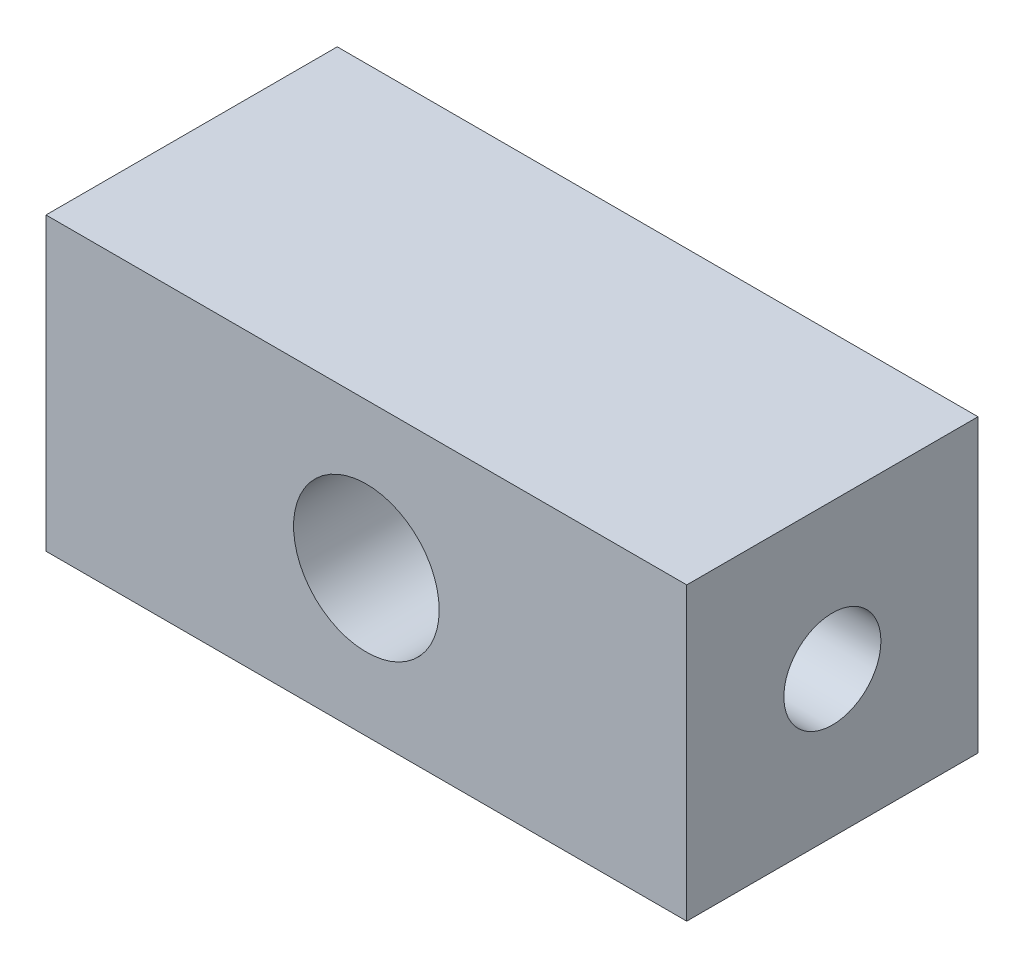
ISO-10303-21;
HEADER;
FILE_DESCRIPTION(('STEP AP214'),'2;1');
FILE_NAME('part.step','',(''),(''),'','','');
FILE_SCHEMA(('AUTOMOTIVE_DESIGN { 1 0 10303 214 1 1 1 1 }'));
ENDSEC;
DATA;
#1=APPLICATION_CONTEXT('core data for automotive mechanical design processes');
#2=APPLICATION_PROTOCOL_DEFINITION('international standard','automotive_design',2000,#1);
#3=PRODUCT_CONTEXT('',#1,'mechanical');
#4=PRODUCT('Part','Part','',(#3));
#5=PRODUCT_RELATED_PRODUCT_CATEGORY('part','',(#4));
#6=PRODUCT_DEFINITION_FORMATION('','',#4);
#7=PRODUCT_DEFINITION_CONTEXT('part definition',#1,'design');
#8=PRODUCT_DEFINITION('design','',#6,#7);
#9=PRODUCT_DEFINITION_SHAPE('','',#8);
#10=(LENGTH_UNIT() NAMED_UNIT(*) SI_UNIT(.MILLI.,.METRE.));
#11=(NAMED_UNIT(*) PLANE_ANGLE_UNIT() SI_UNIT($,.RADIAN.));
#12=(NAMED_UNIT(*) SI_UNIT($,.STERADIAN.) SOLID_ANGLE_UNIT());
#13=UNCERTAINTY_MEASURE_WITH_UNIT(LENGTH_MEASURE(1.E-05),#10,'distance_accuracy_value','');
#14=(GEOMETRIC_REPRESENTATION_CONTEXT(3) GLOBAL_UNCERTAINTY_ASSIGNED_CONTEXT((#13)) GLOBAL_UNIT_ASSIGNED_CONTEXT((#10,
#11,#12)) REPRESENTATION_CONTEXT('',''));
#15=CARTESIAN_POINT('',(0.,0.,0.));
#16=DIRECTION('',(0.,0.,1.));
#17=DIRECTION('',(1.,0.,0.));
#18=AXIS2_PLACEMENT_3D('',#15,#16,#17);
#19=CARTESIAN_POINT('',(0.,0.,15.));
#20=DIRECTION('',(0.,0.,-1.));
#21=DIRECTION('',(-1.,0.,0.));
#22=AXIS2_PLACEMENT_3D('',#19,#20,#21);
#23=PLANE('',#22);
#24=DIRECTION('',(0.,1.,0.));
#25=VECTOR('',#24,1.);
#26=CARTESIAN_POINT('',(33.,-15.,15.));
#27=LINE('',#26,#25);
#28=CARTESIAN_POINT('',(33.,-15.,15.));
#29=VERTEX_POINT('',#28);
#30=CARTESIAN_POINT('',(33.,15.,15.));
#31=VERTEX_POINT('',#30);
#32=EDGE_CURVE('E99',#29,#31,#27,.T.);
#33=ORIENTED_EDGE('',*,*,#32,.T.);
#34=DIRECTION('',(-1.,0.,0.));
#35=VECTOR('',#34,1.);
#36=CARTESIAN_POINT('',(-33.,15.,15.));
#37=LINE('',#36,#35);
#38=CARTESIAN_POINT('',(-33.,15.,15.));
#39=VERTEX_POINT('',#38);
#40=EDGE_CURVE('E94',#31,#39,#37,.T.);
#41=ORIENTED_EDGE('',*,*,#40,.T.);
#42=DIRECTION('',(0.,-1.,0.));
#43=VECTOR('',#42,1.);
#44=CARTESIAN_POINT('',(-33.,-15.,15.));
#45=LINE('',#44,#43);
#46=CARTESIAN_POINT('',(-33.,-15.,15.));
#47=VERTEX_POINT('',#46);
#48=EDGE_CURVE('E97',#39,#47,#45,.T.);
#49=ORIENTED_EDGE('',*,*,#48,.T.);
#50=DIRECTION('',(1.,0.,0.));
#51=VECTOR('',#50,1.);
#52=CARTESIAN_POINT('',(-33.,-15.,15.));
#53=LINE('',#52,#51);
#54=EDGE_CURVE('E64',#47,#29,#53,.T.);
#55=ORIENTED_EDGE('',*,*,#54,.T.);
#56=EDGE_LOOP('',(#33,#41,#49,#55));
#57=FACE_BOUND('',#56,.T.);
#58=CARTESIAN_POINT('',(0.,0.,15.));
#59=DIRECTION('',(0.,0.,1.));
#60=DIRECTION('',(1.,0.,0.));
#61=AXIS2_PLACEMENT_3D('',#58,#59,#60);
#62=CIRCLE('',#61,7.5);
#63=CARTESIAN_POINT('',(7.5,0.,15.));
#64=VERTEX_POINT('',#63);
#65=EDGE_CURVE('E120',#64,#64,#62,.T.);
#66=ORIENTED_EDGE('',*,*,#65,.F.);
#67=EDGE_LOOP('',(#66));
#68=FACE_BOUND('',#67,.T.);
#69=ADVANCED_FACE('F39',(#57,#68),#23,.F.);
#70=CARTESIAN_POINT('',(0.,0.,-15.));
#71=DIRECTION('',(0.,0.,-1.));
#72=DIRECTION('',(-1.,0.,0.));
#73=AXIS2_PLACEMENT_3D('',#70,#71,#72);
#74=PLANE('',#73);
#75=DIRECTION('',(0.,1.,0.));
#76=VECTOR('',#75,1.);
#77=CARTESIAN_POINT('',(33.,-15.,-15.));
#78=LINE('',#77,#76);
#79=CARTESIAN_POINT('',(33.,-15.,-15.));
#80=VERTEX_POINT('',#79);
#81=CARTESIAN_POINT('',(33.,15.,-15.));
#82=VERTEX_POINT('',#81);
#83=EDGE_CURVE('E116',#80,#82,#78,.T.);
#84=ORIENTED_EDGE('',*,*,#83,.F.);
#85=DIRECTION('',(1.,0.,0.));
#86=VECTOR('',#85,1.);
#87=CARTESIAN_POINT('',(-33.,-15.,-15.));
#88=LINE('',#87,#86);
#89=CARTESIAN_POINT('',(-33.,-15.,-15.));
#90=VERTEX_POINT('',#89);
#91=EDGE_CURVE('E87',#90,#80,#88,.T.);
#92=ORIENTED_EDGE('',*,*,#91,.F.);
#93=DIRECTION('',(0.,-1.,0.));
#94=VECTOR('',#93,1.);
#95=CARTESIAN_POINT('',(-33.,-15.,-15.));
#96=LINE('',#95,#94);
#97=CARTESIAN_POINT('',(-33.,15.,-15.));
#98=VERTEX_POINT('',#97);
#99=EDGE_CURVE('E81',#98,#90,#96,.T.);
#100=ORIENTED_EDGE('',*,*,#99,.F.);
#101=DIRECTION('',(-1.,0.,0.));
#102=VECTOR('',#101,1.);
#103=CARTESIAN_POINT('',(-33.,15.,-15.));
#104=LINE('',#103,#102);
#105=EDGE_CURVE('E104',#82,#98,#104,.T.);
#106=ORIENTED_EDGE('',*,*,#105,.F.);
#107=EDGE_LOOP('',(#84,#92,#100,#106));
#108=FACE_BOUND('',#107,.T.);
#109=CARTESIAN_POINT('',(0.,0.,-15.));
#110=DIRECTION('',(0.,0.,1.));
#111=DIRECTION('',(1.,0.,0.));
#112=AXIS2_PLACEMENT_3D('',#109,#110,#111);
#113=CIRCLE('',#112,7.5);
#114=CARTESIAN_POINT('',(7.5,0.,-15.));
#115=VERTEX_POINT('',#114);
#116=EDGE_CURVE('E181',#115,#115,#113,.T.);
#117=ORIENTED_EDGE('',*,*,#116,.T.);
#118=EDGE_LOOP('',(#117));
#119=FACE_BOUND('',#118,.T.);
#120=ADVANCED_FACE('F155',(#108,#119),#74,.T.);
#121=CARTESIAN_POINT('',(33.,-15.,15.));
#122=DIRECTION('',(-1.,0.,0.));
#123=DIRECTION('',(0.,0.,1.));
#124=AXIS2_PLACEMENT_3D('',#121,#122,#123);
#125=PLANE('',#124);
#126=CARTESIAN_POINT('',(33.,0.,0.));
#127=DIRECTION('',(1.,0.,0.));
#128=DIRECTION('',(0.,0.,-1.));
#129=AXIS2_PLACEMENT_3D('',#126,#127,#128);
#130=CIRCLE('',#129,5.);
#131=CARTESIAN_POINT('',(33.,0.,-5.));
#132=VERTEX_POINT('',#131);
#133=EDGE_CURVE('E176',#132,#132,#130,.T.);
#134=ORIENTED_EDGE('',*,*,#133,.F.);
#135=EDGE_LOOP('',(#134));
#136=FACE_BOUND('',#135,.T.);
#137=ORIENTED_EDGE('',*,*,#83,.T.);
#138=DIRECTION('',(0.,0.,-1.));
#139=VECTOR('',#138,1.);
#140=CARTESIAN_POINT('',(33.,15.,15.));
#141=LINE('',#140,#139);
#142=EDGE_CURVE('E11',#31,#82,#141,.T.);
#143=ORIENTED_EDGE('',*,*,#142,.F.);
#144=ORIENTED_EDGE('',*,*,#32,.F.);
#145=DIRECTION('',(0.,0.,-1.));
#146=VECTOR('',#145,1.);
#147=CARTESIAN_POINT('',(33.,-15.,15.));
#148=LINE('',#147,#146);
#149=EDGE_CURVE('E112',#29,#80,#148,.T.);
#150=ORIENTED_EDGE('',*,*,#149,.T.);
#151=EDGE_LOOP('',(#137,#143,#144,#150));
#152=FACE_BOUND('',#151,.T.);
#153=ADVANCED_FACE('F41',(#136,#152),#125,.F.);
#154=CARTESIAN_POINT('',(-33.,15.,15.));
#155=DIRECTION('',(0.,-1.,0.));
#156=DIRECTION('',(0.,0.,-1.));
#157=AXIS2_PLACEMENT_3D('',#154,#155,#156);
#158=PLANE('',#157);
#159=ORIENTED_EDGE('',*,*,#105,.T.);
#160=DIRECTION('',(0.,0.,-1.));
#161=VECTOR('',#160,1.);
#162=CARTESIAN_POINT('',(-33.,15.,15.));
#163=LINE('',#162,#161);
#164=EDGE_CURVE('E55',#39,#98,#163,.T.);
#165=ORIENTED_EDGE('',*,*,#164,.F.);
#166=ORIENTED_EDGE('',*,*,#40,.F.);
#167=ORIENTED_EDGE('',*,*,#142,.T.);
#168=EDGE_LOOP('',(#159,#165,#166,#167));
#169=FACE_BOUND('',#168,.T.);
#170=ADVANCED_FACE('F103',(#169),#158,.F.);
#171=CARTESIAN_POINT('',(-33.,-15.,15.));
#172=DIRECTION('',(1.,0.,0.));
#173=DIRECTION('',(0.,0.,-1.));
#174=AXIS2_PLACEMENT_3D('',#171,#172,#173);
#175=PLANE('',#174);
#176=CARTESIAN_POINT('',(-33.,0.,0.));
#177=DIRECTION('',(1.,0.,0.));
#178=DIRECTION('',(0.,0.,-1.));
#179=AXIS2_PLACEMENT_3D('',#176,#177,#178);
#180=CIRCLE('',#179,5.);
#181=CARTESIAN_POINT('',(-33.,0.,-5.));
#182=VERTEX_POINT('',#181);
#183=EDGE_CURVE('E136',#182,#182,#180,.T.);
#184=ORIENTED_EDGE('',*,*,#183,.T.);
#185=EDGE_LOOP('',(#184));
#186=FACE_BOUND('',#185,.T.);
#187=ORIENTED_EDGE('',*,*,#99,.T.);
#188=DIRECTION('',(0.,0.,-1.));
#189=VECTOR('',#188,1.);
#190=CARTESIAN_POINT('',(-33.,-15.,15.));
#191=LINE('',#190,#189);
#192=EDGE_CURVE('E106',#47,#90,#191,.T.);
#193=ORIENTED_EDGE('',*,*,#192,.F.);
#194=ORIENTED_EDGE('',*,*,#48,.F.);
#195=ORIENTED_EDGE('',*,*,#164,.T.);
#196=EDGE_LOOP('',(#187,#193,#194,#195));
#197=FACE_BOUND('',#196,.T.);
#198=ADVANCED_FACE('F108',(#186,#197),#175,.F.);
#199=CARTESIAN_POINT('',(-33.,-15.,15.));
#200=DIRECTION('',(0.,1.,0.));
#201=DIRECTION('',(0.,0.,1.));
#202=AXIS2_PLACEMENT_3D('',#199,#200,#201);
#203=PLANE('',#202);
#204=ORIENTED_EDGE('',*,*,#91,.T.);
#205=ORIENTED_EDGE('',*,*,#149,.F.);
#206=ORIENTED_EDGE('',*,*,#54,.F.);
#207=ORIENTED_EDGE('',*,*,#192,.T.);
#208=EDGE_LOOP('',(#204,#205,#206,#207));
#209=FACE_BOUND('',#208,.T.);
#210=ADVANCED_FACE('F151',(#209),#203,.F.);
#211=CARTESIAN_POINT('',(0.,0.,15.));
#212=DIRECTION('',(0.,0.,-1.));
#213=DIRECTION('',(-1.,0.,0.));
#214=AXIS2_PLACEMENT_3D('',#211,#212,#213);
#215=CYLINDRICAL_SURFACE('',#214,7.5);
#216=CARTESIAN_POINT('',(-7.5,0.,5.));
#217=CARTESIAN_POINT('',(-7.49999996320963,-0.125608018588548,4.99999996332958));
#218=CARTESIAN_POINT('',(-7.49683780664486,-0.251216670884861,4.99526045609656));
#219=CARTESIAN_POINT('',(-7.48426887523008,-0.501407130429646,4.97637719344278));
#220=CARTESIAN_POINT('',(-7.47486206751269,-0.625988932270019,4.96223338852455));
#221=CARTESIAN_POINT('',(-7.45003382341075,-0.873171719994341,4.92475388496588));
#222=CARTESIAN_POINT('',(-7.43461128487837,-0.99577233861483,4.90141650195336));
#223=CARTESIAN_POINT('',(-7.39811136676745,-1.23813427215697,4.84587344243482));
#224=CARTESIAN_POINT('',(-7.37703158367565,-1.35789435666897,4.8136639964275));
#225=CARTESIAN_POINT('',(-7.32981525375344,-1.59314893798378,4.74098638489601));
#226=CARTESIAN_POINT('',(-7.30370546494928,-1.70866231614512,4.70056186113887));
#227=CARTESIAN_POINT('',(-7.24690654349893,-1.93546860882204,4.61181215495731));
#228=CARTESIAN_POINT('',(-7.21621562725325,-2.04675985824915,4.56348389461676));
#229=CARTESIAN_POINT('',(-7.11817827260879,-2.37341381762447,4.40738741786011));
#230=CARTESIAN_POINT('',(-7.04482484943509,-2.58175996249981,4.28844372586616));
#231=CARTESIAN_POINT('',(-6.88067945428324,-2.99324442404475,4.01334849863612));
#232=CARTESIAN_POINT('',(-6.78893589581815,-3.19444057723902,3.85489609546823));
#233=CARTESIAN_POINT('',(-6.59954434905881,-3.56933031224002,3.51065910883303));
#234=CARTESIAN_POINT('',(-6.5018880214744,-3.74298373794807,3.32483536621252));
#235=CARTESIAN_POINT('',(-6.34919628009922,-3.99366214280298,3.01202024399453));
#236=CARTESIAN_POINT('',(-6.29351311736736,-4.08060552383283,2.89316385177453));
#237=CARTESIAN_POINT('',(-6.18443450280949,-4.24410607449973,2.6475199343164));
#238=CARTESIAN_POINT('',(-6.13103957232405,-4.32066088576891,2.52073061769334));
#239=CARTESIAN_POINT('',(-5.97715554289977,-4.53366662201286,2.12929062591451));
#240=CARTESIAN_POINT('',(-5.88264084043698,-4.65396866792279,1.85293596756271));
#241=CARTESIAN_POINT('',(-5.74940066178898,-4.81686735383668,1.3581492370559));
#242=CARTESIAN_POINT('',(-5.70244638338744,-4.87187088253824,1.1460313437967));
#243=CARTESIAN_POINT('',(-5.64915905133327,-4.93332515657475,0.821257693119102));
#244=CARTESIAN_POINT('',(-5.63425589706967,-4.95029943249,0.711934830996303));
#245=CARTESIAN_POINT('',(-5.61069296640748,-4.97699249744458,0.491757384373762));
#246=CARTESIAN_POINT('',(-5.6020309479698,-4.98671389202271,0.38090336452041));
#247=CARTESIAN_POINT('',(-5.59128886396067,-4.99875512937179,0.157992425508245));
#248=CARTESIAN_POINT('',(-5.58923742257986,-5.00104278396599,0.045932377579079));
#249=CARTESIAN_POINT('',(-5.5918825450767,-4.9980849918467,-0.17800706469552));
#250=CARTESIAN_POINT('',(-5.59657913187616,-4.99283951954458,-0.289886458426012));
#251=CARTESIAN_POINT('',(-5.61252620448123,-4.97490634187683,-0.512636091336137));
#252=CARTESIAN_POINT('',(-5.62378029227563,-4.96221454627213,-0.623505741850759));
#253=CARTESIAN_POINT('',(-5.65238050674852,-4.92961024185719,-0.843396564451179));
#254=CARTESIAN_POINT('',(-5.66972910561612,-4.90969480272766,-0.952416967563864));
#255=CARTESIAN_POINT('',(-5.72818076911837,-4.84163703367357,-1.26603456504467));
#256=CARTESIAN_POINT('',(-5.77653702126334,-4.78429713380928,-1.46736629283408));
#257=CARTESIAN_POINT('',(-5.88774075486078,-4.64674861534595,-1.85759628783405));
#258=CARTESIAN_POINT('',(-5.95059300345544,-4.56653247162609,-2.0464904385054));
#259=CARTESIAN_POINT('',(-6.09910267461486,-4.36685173998334,-2.44754530140424));
#260=CARTESIAN_POINT('',(-6.18679835791932,-4.24272264703471,-2.65662327497203));
#261=CARTESIAN_POINT('',(-6.36729804082079,-3.96670264496565,-3.05348499728716));
#262=CARTESIAN_POINT('',(-6.46010824109834,-3.81477749526626,-3.24124201432436));
#263=CARTESIAN_POINT('',(-6.60779163713999,-3.54969108213473,-3.52437255800004));
#264=CARTESIAN_POINT('',(-6.66328847782504,-3.44464766421749,-3.62713083172277));
#265=CARTESIAN_POINT('',(-6.77217054484313,-3.22531791748826,-3.82347713970009));
#266=CARTESIAN_POINT('',(-6.82555639146258,-3.11103433427816,-3.9170678798286));
#267=CARTESIAN_POINT('',(-6.92883688982357,-2.87366828778324,-4.09438233562589));
#268=CARTESIAN_POINT('',(-6.97873321853711,-2.75059010925358,-4.17811080427028));
#269=CARTESIAN_POINT('',(-7.07374288615761,-2.49611507932345,-4.33494297641303));
#270=CARTESIAN_POINT('',(-7.11885767470596,-2.36472076856899,-4.40804990259985));
#271=CARTESIAN_POINT('',(-7.1947926112122,-2.12083178608808,-4.52955003710702));
#272=CARTESIAN_POINT('',(-7.22668145195663,-2.00967972723592,-4.57997874330749));
#273=CARTESIAN_POINT('',(-7.2859316600916,-1.78295269143194,-4.67290941874381));
#274=CARTESIAN_POINT('',(-7.31329394408637,-1.66737861576613,-4.71541299299981));
#275=CARTESIAN_POINT('',(-7.36291212748662,-1.43245611415626,-4.79200645983731));
#276=CARTESIAN_POINT('',(-7.38517017742725,-1.31310930196114,-4.82609989626979));
#277=CARTESIAN_POINT('',(-7.42408961793734,-1.07138735730615,-4.88544867675417));
#278=CARTESIAN_POINT('',(-7.44075325872844,-0.949013463736592,-4.91070757446615));
#279=CARTESIAN_POINT('',(-7.4681644674329,-0.701493288803491,-4.95214332041752));
#280=CARTESIAN_POINT('',(-7.4788845658993,-0.576336870259732,-4.96827800575267));
#281=CARTESIAN_POINT('',(-7.4940239148013,-0.324780008160031,-4.9910386561188));
#282=CARTESIAN_POINT('',(-7.49844315700379,-0.198379562978779,-4.99766460872505));
#283=CARTESIAN_POINT('',(-7.50086789804063,0.0546163050195368,-5.00130194416532));
#284=CARTESIAN_POINT('',(-7.49887366122603,0.181211719585368,-4.99831372327676));
#285=CARTESIAN_POINT('',(-7.48852351947421,0.433544937832567,-4.98277210202707));
#286=CARTESIAN_POINT('',(-7.48016788605485,0.559282777885928,-4.97021910991058));
#287=CARTESIAN_POINT('',(-7.45811180800349,0.800084092730023,-4.93696015755831));
#288=CARTESIAN_POINT('',(-7.44483013834048,0.915274689503107,-4.91689203663253));
#289=CARTESIAN_POINT('',(-7.41323727394235,1.14332502618366,-4.86892255510859));
#290=CARTESIAN_POINT('',(-7.39492437584217,1.25618396274926,-4.84101854153162));
#291=CARTESIAN_POINT('',(-7.33297199401165,1.59016819827962,-4.74603269888999));
#292=CARTESIAN_POINT('',(-7.28229985688257,1.80689828647146,-4.66764915658682));
#293=CARTESIAN_POINT('',(-7.16240567052806,2.23669773147039,-4.47836285798313));
#294=CARTESIAN_POINT('',(-7.09224590701723,2.44875011842611,-4.36577789105498));
#295=CARTESIAN_POINT('',(-6.94004723718924,2.8516978970661,-4.11391849994205));
#296=CARTESIAN_POINT('',(-6.85800100215921,3.0425801069499,-3.97462759270444));
#297=CARTESIAN_POINT('',(-6.67386338599776,3.42963933761377,-3.64847975744913));
#298=CARTESIAN_POINT('',(-6.57065384591326,3.62188054324072,-3.45758419366078));
#299=CARTESIAN_POINT('',(-6.36427940129081,3.97334834714671,-3.04722158136621));
#300=CARTESIAN_POINT('',(-6.26111457639159,4.13255212685988,-2.82773495453724));
#301=CARTESIAN_POINT('',(-6.07349195966786,4.40311961015302,-2.38214392019828));
#302=CARTESIAN_POINT('',(-5.98818993185449,4.51739093945808,-2.15816986386051));
#303=CARTESIAN_POINT('',(-5.83597435045316,4.71240530724639,-1.69031842127984));
#304=CARTESIAN_POINT('',(-5.76902777392138,4.79320869285461,-1.44647781589623));
#305=CARTESIAN_POINT('',(-5.67333023681701,4.90589604497064,-0.988588649429973));
#306=CARTESIAN_POINT('',(-5.63987506376385,4.94396476310194,-0.777070027915116));
#307=CARTESIAN_POINT('',(-5.59698654785069,4.99248032394649,-0.348567243612225));
#308=CARTESIAN_POINT('',(-5.58752711368552,5.00295716862677,-0.131589276518499));
#309=CARTESIAN_POINT('',(-5.59410544900805,4.99559738764621,0.301609297155851));
#310=CARTESIAN_POINT('',(-5.61015831597501,4.97774399693959,0.517829379343263));
#311=CARTESIAN_POINT('',(-5.66525973970472,4.91492740617482,0.943352637174756));
#312=CARTESIAN_POINT('',(-5.7043389738479,4.8699280383881,1.15264619119367));
#313=CARTESIAN_POINT('',(-5.81317852459072,4.73981418276009,1.61430721309));
#314=CARTESIAN_POINT('',(-5.88833948649796,4.64720557432273,1.86329193737393));
#315=CARTESIAN_POINT('',(-6.0137282216154,4.48217153169634,2.2197721527126));
#316=CARTESIAN_POINT('',(-6.05768608443999,4.4227291606703,2.33588098122704));
#317=CARTESIAN_POINT('',(-6.14853438480218,4.29553797555823,2.5622633756569));
#318=CARTESIAN_POINT('',(-6.19542487694525,4.22778900678103,2.67253683284727));
#319=CARTESIAN_POINT('',(-6.34038233699541,4.0100125161287,2.99813157273274));
#320=CARTESIAN_POINT('',(-6.44119239434723,3.84739387541879,3.20406498890246));
#321=CARTESIAN_POINT('',(-6.5908294854328,3.58070368138863,3.49223623047968));
#322=CARTESIAN_POINT('',(-6.64046727146306,3.48796686520542,3.5848751310009));
#323=CARTESIAN_POINT('',(-6.73828470699057,3.29502624182907,3.76298200605057));
#324=CARTESIAN_POINT('',(-6.78646402214187,3.19482074044039,3.84844834415119));
#325=CARTESIAN_POINT('',(-6.88712610322217,2.97228582382091,4.02347385839299));
#326=CARTESIAN_POINT('',(-6.93922872778525,2.84884898400047,4.11184847540997));
#327=CARTESIAN_POINT('',(-7.03877400576411,2.59315796105784,4.27770219318705));
#328=CARTESIAN_POINT('',(-7.08621876519301,2.46090780863047,4.35518622493486));
#329=CARTESIAN_POINT('',(-7.17506685821063,2.18836443414478,4.49830278427693));
#330=CARTESIAN_POINT('',(-7.21647581452224,2.04807886951547,4.56394635570691));
#331=CARTESIAN_POINT('',(-7.29200187013099,1.76034275764726,4.68245428044414));
#332=CARTESIAN_POINT('',(-7.32612152964091,1.61289474847383,4.73532312146547));
#333=CARTESIAN_POINT('',(-7.37927647812224,1.34555428333911,4.81710032821547));
#334=CARTESIAN_POINT('',(-7.39997893582426,1.22681585673933,4.84872238892977));
#335=CARTESIAN_POINT('',(-7.43582405760531,0.986541218916701,4.90325435730034));
#336=CARTESIAN_POINT('',(-7.45096786434905,0.865005588166455,4.9261660555379));
#337=CARTESIAN_POINT('',(-7.47533722218222,0.620058880061075,4.96294834023699));
#338=CARTESIAN_POINT('',(-7.48456629083545,0.496648962158446,4.97682430043646));
#339=CARTESIAN_POINT('',(-7.49689781286771,0.248826261701855,4.99535032150822));
#340=CARTESIAN_POINT('',(-7.50000003644048,0.124413441706682,5.00000003632167));
#341=CARTESIAN_POINT('',(-7.5,0.,5.));
#342=B_SPLINE_CURVE_WITH_KNOTS('',3,(#216,#217,#218,#219,#220,#221,#222,#223,#224,#225,#226,
#227,#228,#229,#230,#231,#232,#233,#234,#235,#236,#237,#238,#239,#240,#241,#242,#243,#244,#245,
#246,#247,#248,#249,#250,#251,#252,#253,#254,#255,#256,#257,#258,#259,#260,#261,#262,#263,#264,
#265,#266,#267,#268,#269,#270,#271,#272,#273,#274,#275,#276,#277,#278,#279,#280,#281,#282,#283,
#284,#285,#286,#287,#288,#289,#290,#291,#292,#293,#294,#295,#296,#297,#298,#299,#300,#301,#302,
#303,#304,#305,#306,#307,#308,#309,#310,#311,#312,#313,#314,#315,#316,#317,#318,#319,#320,#321,
#322,#323,#324,#325,#326,#327,#328,#329,#330,#331,#332,#333,#334,#335,#336,#337,#338,#339,#340,
#341),.UNSPECIFIED.,.T.,.F.,(4,2,2,2,2,2,2,2,2,2,2,2,2,2,2,2,2,2,2,2,2,2,2,2,2,2,2,2,2,2,2,2,2,
2,2,2,2,2,2,2,2,2,2,2,2,2,2,2,2,2,2,2,2,2,2,2,2,2,2,2,2,2,4),(0.,0.376697150092868,
0.7533962828654,1.13016446348966,1.5070929703719,1.88206910413628,2.2571916123895,
3.00679232609858,3.82000195441008,4.63438651949459,5.10618372652056,5.57808786035318,
6.5193034140896,7.18876311985435,7.52328813363274,7.85769291407032,8.19354375486222,
8.52939573647986,8.86543237335315,9.20160547846822,9.84356710192613,10.4857401421745,
11.2585349135694,12.032288141549,12.5030398312138,12.9736521532471,13.44403673454,
13.9142782967795,14.2923626335413,14.6703703162267,15.0482184414745,15.4259144034603,
15.8053417246619,16.184769541648,16.5641817195628,16.9435777042718,17.2962009039366,
17.6489436346054,18.3538353932503,19.1014251855315,19.8494778884236,20.7158209183258,
21.5827603441875,22.3763648974055,23.1685321808116,23.8182177151969,24.4671965231208,
25.1165595219072,25.7667896111035,26.5902817323984,27.0029102138176,27.4155463806554,
28.2552096763187,28.6754157798874,29.0957174947647,29.5765774176914,30.0572189128906,
30.5374097593981,31.0174316706402,31.3908313299587,31.7641541882901,32.1372548206283,
32.5103694469936),.UNSPECIFIED.);
#343=CARTESIAN_POINT('',(-7.5,0.,5.));
#344=VERTEX_POINT('',#343);
#345=EDGE_CURVE('E43',#344,#344,#342,.T.);
#346=ORIENTED_EDGE('',*,*,#345,.F.);
#347=EDGE_LOOP('',(#346));
#348=FACE_BOUND('',#347,.T.);
#349=CARTESIAN_POINT('',(7.5,0.,-5.));
#350=CARTESIAN_POINT('',(7.49999996320963,-0.125608018588548,-4.99999996332958));
#351=CARTESIAN_POINT('',(7.49683780664486,-0.251216670884861,-4.99526045609656));
#352=CARTESIAN_POINT('',(7.48426887523008,-0.501407130429646,-4.97637719344278));
#353=CARTESIAN_POINT('',(7.47486206751269,-0.625988932270019,-4.96223338852455));
#354=CARTESIAN_POINT('',(7.45003382341075,-0.873171719994341,-4.92475388496588));
#355=CARTESIAN_POINT('',(7.43461128487837,-0.99577233861483,-4.90141650195336));
#356=CARTESIAN_POINT('',(7.39811136676745,-1.23813427215697,-4.84587344243482));
#357=CARTESIAN_POINT('',(7.37703158367565,-1.35789435666897,-4.8136639964275));
#358=CARTESIAN_POINT('',(7.32981525375344,-1.59314893798378,-4.74098638489601));
#359=CARTESIAN_POINT('',(7.30370546494928,-1.70866231614512,-4.70056186113887));
#360=CARTESIAN_POINT('',(7.24690654349893,-1.93546860882204,-4.61181215495731));
#361=CARTESIAN_POINT('',(7.21621562725325,-2.04675985824915,-4.56348389461676));
#362=CARTESIAN_POINT('',(7.11817827260879,-2.37341381762447,-4.40738741786011));
#363=CARTESIAN_POINT('',(7.04482484943509,-2.58175996249981,-4.28844372586616));
#364=CARTESIAN_POINT('',(6.88067945428324,-2.99324442404475,-4.01334849863612));
#365=CARTESIAN_POINT('',(6.78893589581815,-3.19444057723902,-3.85489609546823));
#366=CARTESIAN_POINT('',(6.59954434905881,-3.56933031224002,-3.51065910883303));
#367=CARTESIAN_POINT('',(6.5018880214744,-3.74298373794807,-3.32483536621252));
#368=CARTESIAN_POINT('',(6.34919628009922,-3.99366214280298,-3.01202024399453));
#369=CARTESIAN_POINT('',(6.29351311736736,-4.08060552383283,-2.89316385177453));
#370=CARTESIAN_POINT('',(6.18443450280949,-4.24410607449973,-2.6475199343164));
#371=CARTESIAN_POINT('',(6.13103957232405,-4.32066088576891,-2.52073061769334));
#372=CARTESIAN_POINT('',(5.97715554289977,-4.53366662201286,-2.12929062591451));
#373=CARTESIAN_POINT('',(5.88264084043698,-4.65396866792279,-1.85293596756271));
#374=CARTESIAN_POINT('',(5.74940066178898,-4.81686735383668,-1.3581492370559));
#375=CARTESIAN_POINT('',(5.70244638338744,-4.87187088253824,-1.1460313437967));
#376=CARTESIAN_POINT('',(5.64915905133327,-4.93332515657475,-0.821257693119102));
#377=CARTESIAN_POINT('',(5.63425589706967,-4.95029943249,-0.711934830996303));
#378=CARTESIAN_POINT('',(5.61069296640748,-4.97699249744458,-0.491757384373762));
#379=CARTESIAN_POINT('',(5.6020309479698,-4.98671389202271,-0.38090336452041));
#380=CARTESIAN_POINT('',(5.59128886396067,-4.99875512937179,-0.157992425508245));
#381=CARTESIAN_POINT('',(5.58923742257986,-5.00104278396599,-0.045932377579079));
#382=CARTESIAN_POINT('',(5.5918825450767,-4.9980849918467,0.17800706469552));
#383=CARTESIAN_POINT('',(5.59657913187616,-4.99283951954458,0.289886458426012));
#384=CARTESIAN_POINT('',(5.61252620448123,-4.97490634187683,0.512636091336137));
#385=CARTESIAN_POINT('',(5.62378029227563,-4.96221454627213,0.623505741850759));
#386=CARTESIAN_POINT('',(5.65238050674852,-4.92961024185719,0.843396564451179));
#387=CARTESIAN_POINT('',(5.66972910561612,-4.90969480272766,0.952416967563864));
#388=CARTESIAN_POINT('',(5.72818076911837,-4.84163703367357,1.26603456504467));
#389=CARTESIAN_POINT('',(5.77653702126334,-4.78429713380928,1.46736629283408));
#390=CARTESIAN_POINT('',(5.88774075486078,-4.64674861534595,1.85759628783405));
#391=CARTESIAN_POINT('',(5.95059300345544,-4.56653247162609,2.0464904385054));
#392=CARTESIAN_POINT('',(6.09910267461486,-4.36685173998334,2.44754530140424));
#393=CARTESIAN_POINT('',(6.18679835791932,-4.24272264703471,2.65662327497203));
#394=CARTESIAN_POINT('',(6.36729804082079,-3.96670264496565,3.05348499728716));
#395=CARTESIAN_POINT('',(6.46010824109834,-3.81477749526626,3.24124201432436));
#396=CARTESIAN_POINT('',(6.60779163713999,-3.54969108213473,3.52437255800004));
#397=CARTESIAN_POINT('',(6.66328847782504,-3.44464766421749,3.62713083172277));
#398=CARTESIAN_POINT('',(6.77217054484313,-3.22531791748826,3.82347713970009));
#399=CARTESIAN_POINT('',(6.82555639146258,-3.11103433427816,3.9170678798286));
#400=CARTESIAN_POINT('',(6.92883688982357,-2.87366828778324,4.09438233562589));
#401=CARTESIAN_POINT('',(6.97873321853711,-2.75059010925358,4.17811080427028));
#402=CARTESIAN_POINT('',(7.07374288615761,-2.49611507932345,4.33494297641303));
#403=CARTESIAN_POINT('',(7.11885767470596,-2.36472076856899,4.40804990259985));
#404=CARTESIAN_POINT('',(7.1947926112122,-2.12083178608808,4.52955003710702));
#405=CARTESIAN_POINT('',(7.22668145195663,-2.00967972723592,4.57997874330749));
#406=CARTESIAN_POINT('',(7.2859316600916,-1.78295269143194,4.67290941874381));
#407=CARTESIAN_POINT('',(7.31329394408637,-1.66737861576613,4.71541299299981));
#408=CARTESIAN_POINT('',(7.36291212748662,-1.43245611415626,4.79200645983731));
#409=CARTESIAN_POINT('',(7.38517017742725,-1.31310930196114,4.82609989626979));
#410=CARTESIAN_POINT('',(7.42408961793734,-1.07138735730615,4.88544867675417));
#411=CARTESIAN_POINT('',(7.44075325872844,-0.949013463736592,4.91070757446615));
#412=CARTESIAN_POINT('',(7.4681644674329,-0.701493288803491,4.95214332041752));
#413=CARTESIAN_POINT('',(7.4788845658993,-0.576336870259732,4.96827800575267));
#414=CARTESIAN_POINT('',(7.4940239148013,-0.324780008160031,4.9910386561188));
#415=CARTESIAN_POINT('',(7.49844315700379,-0.198379562978779,4.99766460872505));
#416=CARTESIAN_POINT('',(7.50086789804063,0.0546163050195368,5.00130194416532));
#417=CARTESIAN_POINT('',(7.49887366122603,0.181211719585368,4.99831372327676));
#418=CARTESIAN_POINT('',(7.48852351947421,0.433544937832567,4.98277210202707));
#419=CARTESIAN_POINT('',(7.48016788605485,0.559282777885928,4.97021910991058));
#420=CARTESIAN_POINT('',(7.45811180800349,0.800084092730023,4.93696015755831));
#421=CARTESIAN_POINT('',(7.44483013834048,0.915274689503107,4.91689203663253));
#422=CARTESIAN_POINT('',(7.41323727394235,1.14332502618366,4.86892255510859));
#423=CARTESIAN_POINT('',(7.39492437584217,1.25618396274926,4.84101854153162));
#424=CARTESIAN_POINT('',(7.33297199401165,1.59016819827962,4.74603269888999));
#425=CARTESIAN_POINT('',(7.28229985688257,1.80689828647146,4.66764915658682));
#426=CARTESIAN_POINT('',(7.16240567052806,2.23669773147039,4.47836285798313));
#427=CARTESIAN_POINT('',(7.09224590701723,2.44875011842611,4.36577789105498));
#428=CARTESIAN_POINT('',(6.94004723718924,2.8516978970661,4.11391849994205));
#429=CARTESIAN_POINT('',(6.85800100215921,3.0425801069499,3.97462759270444));
#430=CARTESIAN_POINT('',(6.67386338599776,3.42963933761377,3.64847975744913));
#431=CARTESIAN_POINT('',(6.57065384591326,3.62188054324072,3.45758419366078));
#432=CARTESIAN_POINT('',(6.36427940129081,3.97334834714671,3.04722158136621));
#433=CARTESIAN_POINT('',(6.26111457639159,4.13255212685988,2.82773495453724));
#434=CARTESIAN_POINT('',(6.07349195966786,4.40311961015302,2.38214392019828));
#435=CARTESIAN_POINT('',(5.98818993185449,4.51739093945808,2.15816986386051));
#436=CARTESIAN_POINT('',(5.83597435045316,4.71240530724639,1.69031842127984));
#437=CARTESIAN_POINT('',(5.76902777392138,4.79320869285461,1.44647781589623));
#438=CARTESIAN_POINT('',(5.67333023681701,4.90589604497064,0.988588649429973));
#439=CARTESIAN_POINT('',(5.63987506376385,4.94396476310194,0.777070027915116));
#440=CARTESIAN_POINT('',(5.59698654785069,4.99248032394649,0.348567243612225));
#441=CARTESIAN_POINT('',(5.58752711368552,5.00295716862677,0.131589276518499));
#442=CARTESIAN_POINT('',(5.59410544900805,4.99559738764621,-0.301609297155851));
#443=CARTESIAN_POINT('',(5.61015831597501,4.97774399693959,-0.517829379343263));
#444=CARTESIAN_POINT('',(5.66525973970472,4.91492740617482,-0.943352637174756));
#445=CARTESIAN_POINT('',(5.7043389738479,4.8699280383881,-1.15264619119367));
#446=CARTESIAN_POINT('',(5.81317852459072,4.73981418276009,-1.61430721309));
#447=CARTESIAN_POINT('',(5.88833948649796,4.64720557432273,-1.86329193737393));
#448=CARTESIAN_POINT('',(6.0137282216154,4.48217153169634,-2.2197721527126));
#449=CARTESIAN_POINT('',(6.05768608443999,4.4227291606703,-2.33588098122704));
#450=CARTESIAN_POINT('',(6.14853438480218,4.29553797555823,-2.5622633756569));
#451=CARTESIAN_POINT('',(6.19542487694525,4.22778900678103,-2.67253683284727));
#452=CARTESIAN_POINT('',(6.34038233699541,4.0100125161287,-2.99813157273274));
#453=CARTESIAN_POINT('',(6.44119239434723,3.84739387541879,-3.20406498890246));
#454=CARTESIAN_POINT('',(6.5908294854328,3.58070368138863,-3.49223623047968));
#455=CARTESIAN_POINT('',(6.64046727146306,3.48796686520542,-3.5848751310009));
#456=CARTESIAN_POINT('',(6.73828470699057,3.29502624182907,-3.76298200605057));
#457=CARTESIAN_POINT('',(6.78646402214187,3.19482074044039,-3.84844834415119));
#458=CARTESIAN_POINT('',(6.88712610322217,2.97228582382091,-4.02347385839299));
#459=CARTESIAN_POINT('',(6.93922872778525,2.84884898400047,-4.11184847540997));
#460=CARTESIAN_POINT('',(7.03877400576411,2.59315796105784,-4.27770219318705));
#461=CARTESIAN_POINT('',(7.08621876519301,2.46090780863047,-4.35518622493486));
#462=CARTESIAN_POINT('',(7.17506685821063,2.18836443414478,-4.49830278427693));
#463=CARTESIAN_POINT('',(7.21647581452224,2.04807886951547,-4.56394635570691));
#464=CARTESIAN_POINT('',(7.29200187013099,1.76034275764726,-4.68245428044414));
#465=CARTESIAN_POINT('',(7.32612152964091,1.61289474847383,-4.73532312146547));
#466=CARTESIAN_POINT('',(7.37927647812224,1.34555428333911,-4.81710032821547));
#467=CARTESIAN_POINT('',(7.39997893582426,1.22681585673933,-4.84872238892977));
#468=CARTESIAN_POINT('',(7.43582405760531,0.986541218916701,-4.90325435730034));
#469=CARTESIAN_POINT('',(7.45096786434905,0.865005588166455,-4.9261660555379));
#470=CARTESIAN_POINT('',(7.47533722218222,0.620058880061075,-4.96294834023699));
#471=CARTESIAN_POINT('',(7.48456629083545,0.496648962158446,-4.97682430043646));
#472=CARTESIAN_POINT('',(7.49689781286771,0.248826261701855,-4.99535032150822));
#473=CARTESIAN_POINT('',(7.50000003644048,0.124413441706682,-5.00000003632167));
#474=CARTESIAN_POINT('',(7.5,0.,-5.));
#475=B_SPLINE_CURVE_WITH_KNOTS('',3,(#349,#350,#351,#352,#353,#354,#355,#356,#357,#358,#359,
#360,#361,#362,#363,#364,#365,#366,#367,#368,#369,#370,#371,#372,#373,#374,#375,#376,#377,#378,
#379,#380,#381,#382,#383,#384,#385,#386,#387,#388,#389,#390,#391,#392,#393,#394,#395,#396,#397,
#398,#399,#400,#401,#402,#403,#404,#405,#406,#407,#408,#409,#410,#411,#412,#413,#414,#415,#416,
#417,#418,#419,#420,#421,#422,#423,#424,#425,#426,#427,#428,#429,#430,#431,#432,#433,#434,#435,
#436,#437,#438,#439,#440,#441,#442,#443,#444,#445,#446,#447,#448,#449,#450,#451,#452,#453,#454,
#455,#456,#457,#458,#459,#460,#461,#462,#463,#464,#465,#466,#467,#468,#469,#470,#471,#472,#473,
#474),.UNSPECIFIED.,.T.,.F.,(4,2,2,2,2,2,2,2,2,2,2,2,2,2,2,2,2,2,2,2,2,2,2,2,2,2,2,2,2,2,2,2,2,
2,2,2,2,2,2,2,2,2,2,2,2,2,2,2,2,2,2,2,2,2,2,2,2,2,2,2,2,2,4),(0.,0.376697150092868,
0.7533962828654,1.13016446348966,1.5070929703719,1.88206910413628,2.2571916123895,
3.00679232609858,3.82000195441008,4.63438651949459,5.10618372652056,5.57808786035318,
6.5193034140896,7.18876311985435,7.52328813363274,7.85769291407032,8.19354375486222,
8.52939573647986,8.86543237335315,9.20160547846822,9.84356710192613,10.4857401421745,
11.2585349135694,12.032288141549,12.5030398312138,12.9736521532471,13.44403673454,
13.9142782967795,14.2923626335413,14.6703703162267,15.0482184414745,15.4259144034603,
15.8053417246619,16.184769541648,16.5641817195628,16.9435777042718,17.2962009039366,
17.6489436346054,18.3538353932503,19.1014251855315,19.8494778884236,20.7158209183258,
21.5827603441875,22.3763648974055,23.1685321808116,23.8182177151969,24.4671965231208,
25.1165595219072,25.7667896111035,26.5902817323984,27.0029102138176,27.4155463806554,
28.2552096763187,28.6754157798874,29.0957174947647,29.5765774176914,30.0572189128906,
30.5374097593981,31.0174316706402,31.3908313299587,31.7641541882901,32.1372548206283,
32.5103694469936),.UNSPECIFIED.);
#476=CARTESIAN_POINT('',(7.5,0.,-5.));
#477=VERTEX_POINT('',#476);
#478=EDGE_CURVE('E130',#477,#477,#475,.T.);
#479=ORIENTED_EDGE('',*,*,#478,.F.);
#480=EDGE_LOOP('',(#479));
#481=FACE_BOUND('',#480,.T.);
#482=ORIENTED_EDGE('',*,*,#65,.T.);
#483=EDGE_LOOP('',(#482));
#484=FACE_BOUND('',#483,.T.);
#485=ORIENTED_EDGE('',*,*,#116,.F.);
#486=EDGE_LOOP('',(#485));
#487=FACE_BOUND('',#486,.T.);
#488=ADVANCED_FACE('F137',(#348,#481,#484,#487),#215,.F.);
#489=CARTESIAN_POINT('',(-33.,0.,0.));
#490=DIRECTION('',(1.,0.,0.));
#491=DIRECTION('',(0.,0.,-1.));
#492=AXIS2_PLACEMENT_3D('',#489,#490,#491);
#493=CYLINDRICAL_SURFACE('',#492,5.);
#494=ORIENTED_EDGE('',*,*,#478,.T.);
#495=EDGE_LOOP('',(#494));
#496=FACE_BOUND('',#495,.T.);
#497=ORIENTED_EDGE('',*,*,#133,.T.);
#498=EDGE_LOOP('',(#497));
#499=FACE_BOUND('',#498,.T.);
#500=ADVANCED_FACE('F140',(#496,#499),#493,.F.);
#501=ORIENTED_EDGE('',*,*,#345,.T.);
#502=EDGE_LOOP('',(#501));
#503=FACE_BOUND('',#502,.T.);
#504=ORIENTED_EDGE('',*,*,#183,.F.);
#505=EDGE_LOOP('',(#504));
#506=FACE_BOUND('',#505,.T.);
#507=ADVANCED_FACE('F143',(#503,#506),#493,.F.);
#508=CLOSED_SHELL('',(#69,#120,#153,#170,#198,#210,#488,#500,#507));
#509=MANIFOLD_SOLID_BREP('B2',#508);
#510=ADVANCED_BREP_SHAPE_REPRESENTATION('',(#18,#509),#14);
#511=SHAPE_DEFINITION_REPRESENTATION(#9,#510);
ENDSEC;
END-ISO-10303-21;
